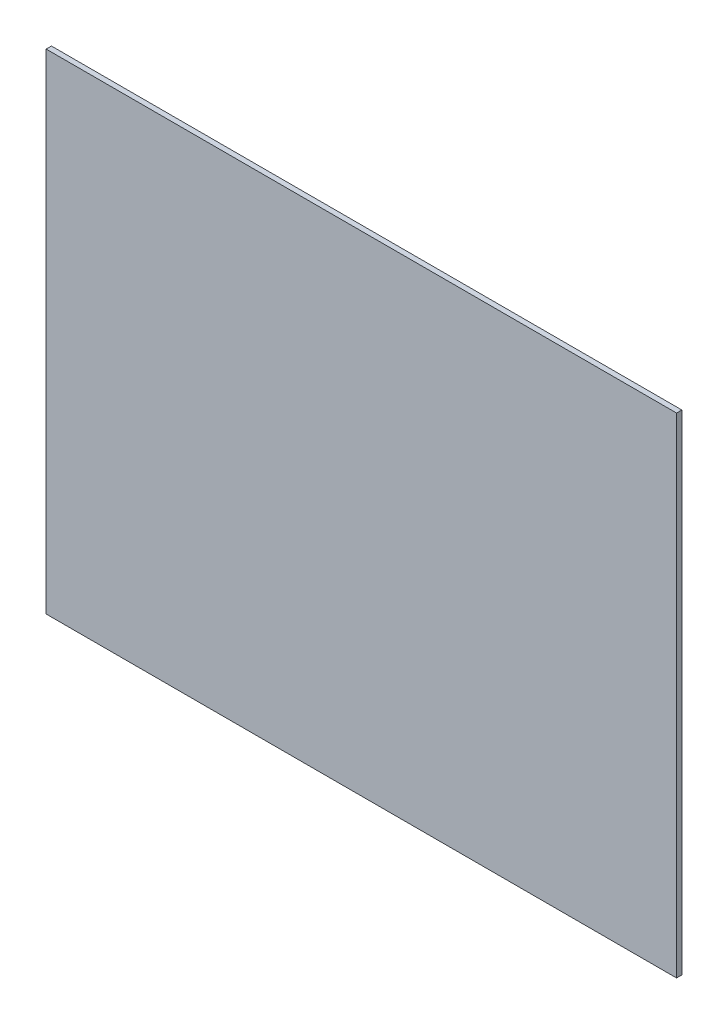
ISO-10303-21;
HEADER;
FILE_DESCRIPTION(('STEP AP214'),'2;1');
FILE_NAME('part.step','',(''),(''),'','','');
FILE_SCHEMA(('AUTOMOTIVE_DESIGN { 1 0 10303 214 1 1 1 1 }'));
ENDSEC;
DATA;
#1=APPLICATION_CONTEXT('core data for automotive mechanical design processes');
#2=APPLICATION_PROTOCOL_DEFINITION('international standard','automotive_design',2000,#1);
#3=PRODUCT_CONTEXT('',#1,'mechanical');
#4=PRODUCT('Part','Part','',(#3));
#5=PRODUCT_RELATED_PRODUCT_CATEGORY('part','',(#4));
#6=PRODUCT_DEFINITION_FORMATION('','',#4);
#7=PRODUCT_DEFINITION_CONTEXT('part definition',#1,'design');
#8=PRODUCT_DEFINITION('design','',#6,#7);
#9=PRODUCT_DEFINITION_SHAPE('','',#8);
#10=(LENGTH_UNIT() NAMED_UNIT(*) SI_UNIT(.MILLI.,.METRE.));
#11=(NAMED_UNIT(*) PLANE_ANGLE_UNIT() SI_UNIT($,.RADIAN.));
#12=(NAMED_UNIT(*) SI_UNIT($,.STERADIAN.) SOLID_ANGLE_UNIT());
#13=UNCERTAINTY_MEASURE_WITH_UNIT(LENGTH_MEASURE(1.E-05),#10,'distance_accuracy_value','');
#14=(GEOMETRIC_REPRESENTATION_CONTEXT(3) GLOBAL_UNCERTAINTY_ASSIGNED_CONTEXT((#13)) GLOBAL_UNIT_ASSIGNED_CONTEXT((#10,
#11,#12)) REPRESENTATION_CONTEXT('',''));
#15=CARTESIAN_POINT('',(0.,0.,0.));
#16=DIRECTION('',(0.,0.,1.));
#17=DIRECTION('',(1.,0.,0.));
#18=AXIS2_PLACEMENT_3D('',#15,#16,#17);
#19=CARTESIAN_POINT('',(268.,-208.,2.2479));
#20=DIRECTION('',(-1.,0.,0.));
#21=DIRECTION('',(0.,0.,1.));
#22=AXIS2_PLACEMENT_3D('',#19,#20,#21);
#23=PLANE('',#22);
#24=DIRECTION('',(0.,1.,0.));
#25=VECTOR('',#24,1.);
#26=CARTESIAN_POINT('',(268.,-208.,-2.2479));
#27=LINE('',#26,#25);
#28=CARTESIAN_POINT('',(268.,-208.,-2.2479));
#29=VERTEX_POINT('',#28);
#30=CARTESIAN_POINT('',(268.,208.,-2.2479));
#31=VERTEX_POINT('',#30);
#32=EDGE_CURVE('E96',#29,#31,#27,.T.);
#33=ORIENTED_EDGE('',*,*,#32,.T.);
#34=DIRECTION('',(0.,0.,-1.));
#35=VECTOR('',#34,1.);
#36=CARTESIAN_POINT('',(268.,208.,2.2479));
#37=LINE('',#36,#35);
#38=CARTESIAN_POINT('',(268.,208.,2.2479));
#39=VERTEX_POINT('',#38);
#40=EDGE_CURVE('E11',#39,#31,#37,.T.);
#41=ORIENTED_EDGE('',*,*,#40,.F.);
#42=DIRECTION('',(0.,1.,0.));
#43=VECTOR('',#42,1.);
#44=CARTESIAN_POINT('',(268.,-208.,2.2479));
#45=LINE('',#44,#43);
#46=CARTESIAN_POINT('',(268.,-208.,2.2479));
#47=VERTEX_POINT('',#46);
#48=EDGE_CURVE('E84',#47,#39,#45,.T.);
#49=ORIENTED_EDGE('',*,*,#48,.F.);
#50=DIRECTION('',(0.,0.,-1.));
#51=VECTOR('',#50,1.);
#52=CARTESIAN_POINT('',(268.,-208.,2.2479));
#53=LINE('',#52,#51);
#54=EDGE_CURVE('E92',#47,#29,#53,.T.);
#55=ORIENTED_EDGE('',*,*,#54,.T.);
#56=EDGE_LOOP('',(#33,#41,#49,#55));
#57=FACE_BOUND('',#56,.T.);
#58=ADVANCED_FACE('F33',(#57),#23,.F.);
#59=CARTESIAN_POINT('',(-268.,208.,2.2479));
#60=DIRECTION('',(0.,-1.,0.));
#61=DIRECTION('',(0.,0.,-1.));
#62=AXIS2_PLACEMENT_3D('',#59,#60,#61);
#63=PLANE('',#62);
#64=DIRECTION('',(-1.,0.,0.));
#65=VECTOR('',#64,1.);
#66=CARTESIAN_POINT('',(-268.,208.,-2.2479));
#67=LINE('',#66,#65);
#68=CARTESIAN_POINT('',(-268.,208.,-2.2479));
#69=VERTEX_POINT('',#68);
#70=EDGE_CURVE('E88',#31,#69,#67,.T.);
#71=ORIENTED_EDGE('',*,*,#70,.T.);
#72=DIRECTION('',(0.,0.,-1.));
#73=VECTOR('',#72,1.);
#74=CARTESIAN_POINT('',(-268.,208.,2.2479));
#75=LINE('',#74,#73);
#76=CARTESIAN_POINT('',(-268.,208.,2.2479));
#77=VERTEX_POINT('',#76);
#78=EDGE_CURVE('E41',#77,#69,#75,.T.);
#79=ORIENTED_EDGE('',*,*,#78,.F.);
#80=DIRECTION('',(-1.,0.,0.));
#81=VECTOR('',#80,1.);
#82=CARTESIAN_POINT('',(-268.,208.,2.2479));
#83=LINE('',#82,#81);
#84=EDGE_CURVE('E79',#39,#77,#83,.T.);
#85=ORIENTED_EDGE('',*,*,#84,.F.);
#86=ORIENTED_EDGE('',*,*,#40,.T.);
#87=EDGE_LOOP('',(#71,#79,#85,#86));
#88=FACE_BOUND('',#87,.T.);
#89=ADVANCED_FACE('F87',(#88),#63,.F.);
#90=CARTESIAN_POINT('',(-268.,-208.,2.2479));
#91=DIRECTION('',(1.,0.,0.));
#92=DIRECTION('',(0.,0.,-1.));
#93=AXIS2_PLACEMENT_3D('',#90,#91,#92);
#94=PLANE('',#93);
#95=DIRECTION('',(0.,-1.,0.));
#96=VECTOR('',#95,1.);
#97=CARTESIAN_POINT('',(-268.,-208.,-2.2479));
#98=LINE('',#97,#96);
#99=CARTESIAN_POINT('',(-268.,-208.,-2.2479));
#100=VERTEX_POINT('',#99);
#101=EDGE_CURVE('E66',#69,#100,#98,.T.);
#102=ORIENTED_EDGE('',*,*,#101,.T.);
#103=DIRECTION('',(0.,0.,-1.));
#104=VECTOR('',#103,1.);
#105=CARTESIAN_POINT('',(-268.,-208.,2.2479));
#106=LINE('',#105,#104);
#107=CARTESIAN_POINT('',(-268.,-208.,2.2479));
#108=VERTEX_POINT('',#107);
#109=EDGE_CURVE('E89',#108,#100,#106,.T.);
#110=ORIENTED_EDGE('',*,*,#109,.F.);
#111=DIRECTION('',(0.,-1.,0.));
#112=VECTOR('',#111,1.);
#113=CARTESIAN_POINT('',(-268.,-208.,2.2479));
#114=LINE('',#113,#112);
#115=EDGE_CURVE('E82',#77,#108,#114,.T.);
#116=ORIENTED_EDGE('',*,*,#115,.F.);
#117=ORIENTED_EDGE('',*,*,#78,.T.);
#118=EDGE_LOOP('',(#102,#110,#116,#117));
#119=FACE_BOUND('',#118,.T.);
#120=ADVANCED_FACE('F90',(#119),#94,.F.);
#121=CARTESIAN_POINT('',(-268.,-208.,2.2479));
#122=DIRECTION('',(0.,1.,0.));
#123=DIRECTION('',(0.,0.,1.));
#124=AXIS2_PLACEMENT_3D('',#121,#122,#123);
#125=PLANE('',#124);
#126=DIRECTION('',(1.,0.,0.));
#127=VECTOR('',#126,1.);
#128=CARTESIAN_POINT('',(-268.,-208.,-2.2479));
#129=LINE('',#128,#127);
#130=EDGE_CURVE('E72',#100,#29,#129,.T.);
#131=ORIENTED_EDGE('',*,*,#130,.T.);
#132=ORIENTED_EDGE('',*,*,#54,.F.);
#133=DIRECTION('',(1.,0.,0.));
#134=VECTOR('',#133,1.);
#135=CARTESIAN_POINT('',(-268.,-208.,2.2479));
#136=LINE('',#135,#134);
#137=EDGE_CURVE('E49',#108,#47,#136,.T.);
#138=ORIENTED_EDGE('',*,*,#137,.F.);
#139=ORIENTED_EDGE('',*,*,#109,.T.);
#140=EDGE_LOOP('',(#131,#132,#138,#139));
#141=FACE_BOUND('',#140,.T.);
#142=ADVANCED_FACE('F103',(#141),#125,.F.);
#143=CARTESIAN_POINT('',(0.,0.,2.2479));
#144=DIRECTION('',(0.,0.,-1.));
#145=DIRECTION('',(-1.,0.,0.));
#146=AXIS2_PLACEMENT_3D('',#143,#144,#145);
#147=PLANE('',#146);
#148=ORIENTED_EDGE('',*,*,#48,.T.);
#149=ORIENTED_EDGE('',*,*,#84,.T.);
#150=ORIENTED_EDGE('',*,*,#115,.T.);
#151=ORIENTED_EDGE('',*,*,#137,.T.);
#152=EDGE_LOOP('',(#148,#149,#150,#151));
#153=FACE_BOUND('',#152,.T.);
#154=ADVANCED_FACE('F80',(#153),#147,.F.);
#155=CARTESIAN_POINT('',(0.,0.,-2.2479));
#156=DIRECTION('',(0.,0.,-1.));
#157=DIRECTION('',(-1.,0.,0.));
#158=AXIS2_PLACEMENT_3D('',#155,#156,#157);
#159=PLANE('',#158);
#160=ORIENTED_EDGE('',*,*,#32,.F.);
#161=ORIENTED_EDGE('',*,*,#130,.F.);
#162=ORIENTED_EDGE('',*,*,#101,.F.);
#163=ORIENTED_EDGE('',*,*,#70,.F.);
#164=EDGE_LOOP('',(#160,#161,#162,#163));
#165=FACE_BOUND('',#164,.T.);
#166=ADVANCED_FACE('F106',(#165),#159,.T.);
#167=CLOSED_SHELL('',(#58,#89,#120,#142,#154,#166));
#168=MANIFOLD_SOLID_BREP('B2',#167);
#169=ADVANCED_BREP_SHAPE_REPRESENTATION('',(#18,#168),#14);
#170=SHAPE_DEFINITION_REPRESENTATION(#9,#169);
ENDSEC;
END-ISO-10303-21;
